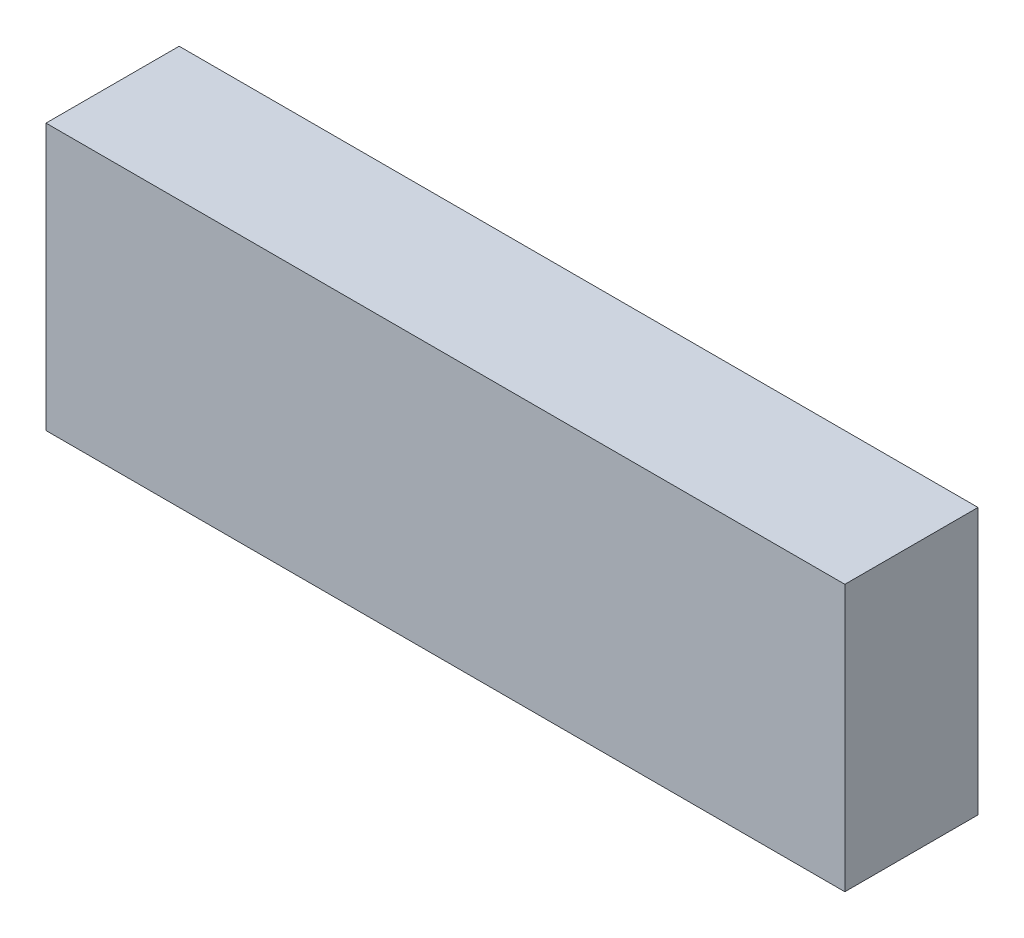
ISO-10303-21;
HEADER;
FILE_DESCRIPTION(('STEP AP214'),'2;1');
FILE_NAME('part.step','',(''),(''),'','','');
FILE_SCHEMA(('AUTOMOTIVE_DESIGN { 1 0 10303 214 1 1 1 1 }'));
ENDSEC;
DATA;
#1=APPLICATION_CONTEXT('core data for automotive mechanical design processes');
#2=APPLICATION_PROTOCOL_DEFINITION('international standard','automotive_design',2000,#1);
#3=PRODUCT_CONTEXT('',#1,'mechanical');
#4=PRODUCT('Part','Part','',(#3));
#5=PRODUCT_RELATED_PRODUCT_CATEGORY('part','',(#4));
#6=PRODUCT_DEFINITION_FORMATION('','',#4);
#7=PRODUCT_DEFINITION_CONTEXT('part definition',#1,'design');
#8=PRODUCT_DEFINITION('design','',#6,#7);
#9=PRODUCT_DEFINITION_SHAPE('','',#8);
#10=(LENGTH_UNIT() NAMED_UNIT(*) SI_UNIT(.MILLI.,.METRE.));
#11=(NAMED_UNIT(*) PLANE_ANGLE_UNIT() SI_UNIT($,.RADIAN.));
#12=(NAMED_UNIT(*) SI_UNIT($,.STERADIAN.) SOLID_ANGLE_UNIT());
#13=UNCERTAINTY_MEASURE_WITH_UNIT(LENGTH_MEASURE(1.E-05),#10,'distance_accuracy_value','');
#14=(GEOMETRIC_REPRESENTATION_CONTEXT(3) GLOBAL_UNCERTAINTY_ASSIGNED_CONTEXT((#13)) GLOBAL_UNIT_ASSIGNED_CONTEXT((#10,
#11,#12)) REPRESENTATION_CONTEXT('',''));
#15=CARTESIAN_POINT('',(0.,0.,0.));
#16=DIRECTION('',(0.,0.,1.));
#17=DIRECTION('',(1.,0.,0.));
#18=AXIS2_PLACEMENT_3D('',#15,#16,#17);
#19=CARTESIAN_POINT('',(1.375,0.875,0.));
#20=DIRECTION('',(1.,0.,0.));
#21=DIRECTION('',(0.,0.,1.));
#22=AXIS2_PLACEMENT_3D('',#19,#20,#21);
#23=PLANE('',#22);
#24=DIRECTION('',(0.,1.,0.));
#25=VECTOR('',#24,1.);
#26=CARTESIAN_POINT('',(1.375,0.875,0.1));
#27=LINE('',#26,#25);
#28=CARTESIAN_POINT('',(1.375,0.875,0.1));
#29=VERTEX_POINT('',#28);
#30=CARTESIAN_POINT('',(1.375,1.075,0.1));
#31=VERTEX_POINT('',#30);
#32=EDGE_CURVE('E11',#29,#31,#27,.T.);
#33=ORIENTED_EDGE('',*,*,#32,.T.);
#34=DIRECTION('',(0.,0.,1.));
#35=VECTOR('',#34,1.);
#36=CARTESIAN_POINT('',(1.375,1.075,0.));
#37=LINE('',#36,#35);
#38=CARTESIAN_POINT('',(1.375,1.075,0.));
#39=VERTEX_POINT('',#38);
#40=EDGE_CURVE('E24',#39,#31,#37,.T.);
#41=ORIENTED_EDGE('',*,*,#40,.F.);
#42=DIRECTION('',(0.,1.,0.));
#43=VECTOR('',#42,1.);
#44=CARTESIAN_POINT('',(1.375,0.875,0.));
#45=LINE('',#44,#43);
#46=CARTESIAN_POINT('',(1.375,0.875,0.));
#47=VERTEX_POINT('',#46);
#48=EDGE_CURVE('E86',#47,#39,#45,.T.);
#49=ORIENTED_EDGE('',*,*,#48,.F.);
#50=DIRECTION('',(0.,0.,1.));
#51=VECTOR('',#50,1.);
#52=CARTESIAN_POINT('',(1.375,0.875,0.));
#53=LINE('',#52,#51);
#54=EDGE_CURVE('E36',#47,#29,#53,.T.);
#55=ORIENTED_EDGE('',*,*,#54,.T.);
#56=EDGE_LOOP('',(#33,#41,#49,#55));
#57=FACE_BOUND('',#56,.T.);
#58=ADVANCED_FACE('F17',(#57),#23,.F.);
#59=CARTESIAN_POINT('',(1.975,0.875,0.));
#60=DIRECTION('',(1.,0.,0.));
#61=DIRECTION('',(0.,0.,1.));
#62=AXIS2_PLACEMENT_3D('',#59,#60,#61);
#63=PLANE('',#62);
#64=DIRECTION('',(0.,0.,1.));
#65=VECTOR('',#64,1.);
#66=CARTESIAN_POINT('',(1.975,0.875,0.));
#67=LINE('',#66,#65);
#68=CARTESIAN_POINT('',(1.975,0.875,0.));
#69=VERTEX_POINT('',#68);
#70=CARTESIAN_POINT('',(1.975,0.875,0.1));
#71=VERTEX_POINT('',#70);
#72=EDGE_CURVE('E83',#69,#71,#67,.T.);
#73=ORIENTED_EDGE('',*,*,#72,.F.);
#74=DIRECTION('',(0.,1.,0.));
#75=VECTOR('',#74,1.);
#76=CARTESIAN_POINT('',(1.975,0.875,0.));
#77=LINE('',#76,#75);
#78=CARTESIAN_POINT('',(1.975,1.075,0.));
#79=VERTEX_POINT('',#78);
#80=EDGE_CURVE('E63',#69,#79,#77,.T.);
#81=ORIENTED_EDGE('',*,*,#80,.T.);
#82=DIRECTION('',(0.,0.,1.));
#83=VECTOR('',#82,1.);
#84=CARTESIAN_POINT('',(1.975,1.075,0.));
#85=LINE('',#84,#83);
#86=CARTESIAN_POINT('',(1.975,1.075,0.1));
#87=VERTEX_POINT('',#86);
#88=EDGE_CURVE('E57',#79,#87,#85,.T.);
#89=ORIENTED_EDGE('',*,*,#88,.T.);
#90=DIRECTION('',(0.,1.,0.));
#91=VECTOR('',#90,1.);
#92=CARTESIAN_POINT('',(1.975,0.875,0.1));
#93=LINE('',#92,#91);
#94=EDGE_CURVE('E60',#71,#87,#93,.T.);
#95=ORIENTED_EDGE('',*,*,#94,.F.);
#96=EDGE_LOOP('',(#73,#81,#89,#95));
#97=FACE_BOUND('',#96,.T.);
#98=ADVANCED_FACE('F59',(#97),#63,.T.);
#99=CARTESIAN_POINT('',(1.375,0.875,0.));
#100=DIRECTION('',(0.,1.,0.));
#101=DIRECTION('',(0.,0.,1.));
#102=AXIS2_PLACEMENT_3D('',#99,#100,#101);
#103=PLANE('',#102);
#104=ORIENTED_EDGE('',*,*,#72,.T.);
#105=DIRECTION('',(1.,0.,0.));
#106=VECTOR('',#105,1.);
#107=CARTESIAN_POINT('',(1.375,0.875,0.1));
#108=LINE('',#107,#106);
#109=EDGE_CURVE('E71',#29,#71,#108,.T.);
#110=ORIENTED_EDGE('',*,*,#109,.F.);
#111=ORIENTED_EDGE('',*,*,#54,.F.);
#112=DIRECTION('',(1.,0.,0.));
#113=VECTOR('',#112,1.);
#114=CARTESIAN_POINT('',(1.375,0.875,0.));
#115=LINE('',#114,#113);
#116=EDGE_CURVE('E76',#47,#69,#115,.T.);
#117=ORIENTED_EDGE('',*,*,#116,.T.);
#118=EDGE_LOOP('',(#104,#110,#111,#117));
#119=FACE_BOUND('',#118,.T.);
#120=ADVANCED_FACE('F91',(#119),#103,.F.);
#121=CARTESIAN_POINT('',(1.375,1.075,0.));
#122=DIRECTION('',(0.,1.,0.));
#123=DIRECTION('',(0.,0.,1.));
#124=AXIS2_PLACEMENT_3D('',#121,#122,#123);
#125=PLANE('',#124);
#126=DIRECTION('',(1.,0.,0.));
#127=VECTOR('',#126,1.);
#128=CARTESIAN_POINT('',(1.375,1.075,0.));
#129=LINE('',#128,#127);
#130=EDGE_CURVE('E74',#39,#79,#129,.T.);
#131=ORIENTED_EDGE('',*,*,#130,.F.);
#132=ORIENTED_EDGE('',*,*,#40,.T.);
#133=DIRECTION('',(1.,0.,0.));
#134=VECTOR('',#133,1.);
#135=CARTESIAN_POINT('',(1.375,1.075,0.1));
#136=LINE('',#135,#134);
#137=EDGE_CURVE('E69',#31,#87,#136,.T.);
#138=ORIENTED_EDGE('',*,*,#137,.T.);
#139=ORIENTED_EDGE('',*,*,#88,.F.);
#140=EDGE_LOOP('',(#131,#132,#138,#139));
#141=FACE_BOUND('',#140,.T.);
#142=ADVANCED_FACE('F73',(#141),#125,.T.);
#143=CARTESIAN_POINT('',(1.375,0.875,0.));
#144=DIRECTION('',(0.,0.,1.));
#145=DIRECTION('',(1.,0.,0.));
#146=AXIS2_PLACEMENT_3D('',#143,#144,#145);
#147=PLANE('',#146);
#148=ORIENTED_EDGE('',*,*,#130,.T.);
#149=ORIENTED_EDGE('',*,*,#80,.F.);
#150=ORIENTED_EDGE('',*,*,#116,.F.);
#151=ORIENTED_EDGE('',*,*,#48,.T.);
#152=EDGE_LOOP('',(#148,#149,#150,#151));
#153=FACE_BOUND('',#152,.T.);
#154=ADVANCED_FACE('F89',(#153),#147,.F.);
#155=CARTESIAN_POINT('',(1.375,0.875,0.1));
#156=DIRECTION('',(0.,0.,1.));
#157=DIRECTION('',(1.,0.,0.));
#158=AXIS2_PLACEMENT_3D('',#155,#156,#157);
#159=PLANE('',#158);
#160=ORIENTED_EDGE('',*,*,#32,.F.);
#161=ORIENTED_EDGE('',*,*,#109,.T.);
#162=ORIENTED_EDGE('',*,*,#94,.T.);
#163=ORIENTED_EDGE('',*,*,#137,.F.);
#164=EDGE_LOOP('',(#160,#161,#162,#163));
#165=FACE_BOUND('',#164,.T.);
#166=ADVANCED_FACE('F68',(#165),#159,.T.);
#167=CLOSED_SHELL('',(#58,#98,#120,#142,#154,#166));
#168=MANIFOLD_SOLID_BREP('B1',#167);
#169=ADVANCED_BREP_SHAPE_REPRESENTATION('',(#18,#168),#14);
#170=SHAPE_DEFINITION_REPRESENTATION(#9,#169);
ENDSEC;
END-ISO-10303-21;
